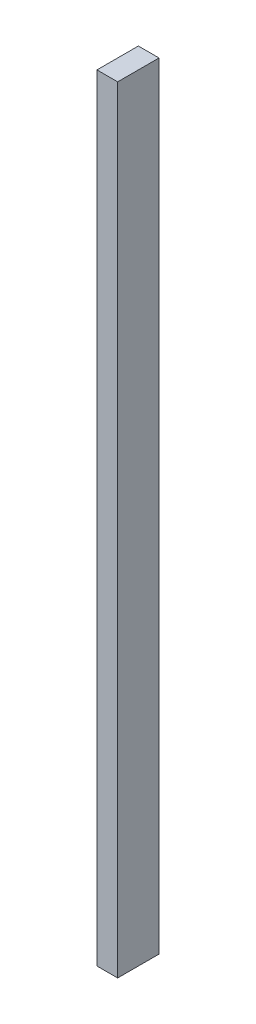
ISO-10303-21;
HEADER;
FILE_DESCRIPTION(('STEP AP214'),'2;1');
FILE_NAME('part.step','',(''),(''),'','','');
FILE_SCHEMA(('AUTOMOTIVE_DESIGN { 1 0 10303 214 1 1 1 1 }'));
ENDSEC;
DATA;
#1=APPLICATION_CONTEXT('core data for automotive mechanical design processes');
#2=APPLICATION_PROTOCOL_DEFINITION('international standard','automotive_design',2000,#1);
#3=PRODUCT_CONTEXT('',#1,'mechanical');
#4=PRODUCT('Part','Part','',(#3));
#5=PRODUCT_RELATED_PRODUCT_CATEGORY('part','',(#4));
#6=PRODUCT_DEFINITION_FORMATION('','',#4);
#7=PRODUCT_DEFINITION_CONTEXT('part definition',#1,'design');
#8=PRODUCT_DEFINITION('design','',#6,#7);
#9=PRODUCT_DEFINITION_SHAPE('','',#8);
#10=(LENGTH_UNIT() NAMED_UNIT(*) SI_UNIT(.MILLI.,.METRE.));
#11=(NAMED_UNIT(*) PLANE_ANGLE_UNIT() SI_UNIT($,.RADIAN.));
#12=(NAMED_UNIT(*) SI_UNIT($,.STERADIAN.) SOLID_ANGLE_UNIT());
#13=UNCERTAINTY_MEASURE_WITH_UNIT(LENGTH_MEASURE(1.E-05),#10,'distance_accuracy_value','');
#14=(GEOMETRIC_REPRESENTATION_CONTEXT(3) GLOBAL_UNCERTAINTY_ASSIGNED_CONTEXT((#13)) GLOBAL_UNIT_ASSIGNED_CONTEXT((#10,
#11,#12)) REPRESENTATION_CONTEXT('',''));
#15=CARTESIAN_POINT('',(0.,0.,0.));
#16=DIRECTION('',(0.,0.,1.));
#17=DIRECTION('',(1.,0.,0.));
#18=AXIS2_PLACEMENT_3D('',#15,#16,#17);
#19=CARTESIAN_POINT('',(0.,0.,1.6));
#20=DIRECTION('',(-1.,0.,0.));
#21=DIRECTION('',(0.,0.,1.));
#22=AXIS2_PLACEMENT_3D('',#19,#20,#21);
#23=PLANE('',#22);
#24=DIRECTION('',(0.,1.,0.));
#25=VECTOR('',#24,1.);
#26=CARTESIAN_POINT('',(0.,0.,0.));
#27=LINE('',#26,#25);
#28=CARTESIAN_POINT('',(0.,0.,0.));
#29=VERTEX_POINT('',#28);
#30=CARTESIAN_POINT('',(0.,30.,0.));
#31=VERTEX_POINT('',#30);
#32=EDGE_CURVE('E96',#29,#31,#27,.T.);
#33=ORIENTED_EDGE('',*,*,#32,.T.);
#34=DIRECTION('',(0.,0.,-1.));
#35=VECTOR('',#34,1.);
#36=CARTESIAN_POINT('',(0.,30.,1.6));
#37=LINE('',#36,#35);
#38=CARTESIAN_POINT('',(0.,30.,1.6));
#39=VERTEX_POINT('',#38);
#40=EDGE_CURVE('E11',#39,#31,#37,.T.);
#41=ORIENTED_EDGE('',*,*,#40,.F.);
#42=DIRECTION('',(0.,1.,0.));
#43=VECTOR('',#42,1.);
#44=CARTESIAN_POINT('',(0.,0.,1.6));
#45=LINE('',#44,#43);
#46=CARTESIAN_POINT('',(0.,0.,1.6));
#47=VERTEX_POINT('',#46);
#48=EDGE_CURVE('E84',#47,#39,#45,.T.);
#49=ORIENTED_EDGE('',*,*,#48,.F.);
#50=DIRECTION('',(0.,0.,-1.));
#51=VECTOR('',#50,1.);
#52=CARTESIAN_POINT('',(0.,0.,1.6));
#53=LINE('',#52,#51);
#54=EDGE_CURVE('E92',#47,#29,#53,.T.);
#55=ORIENTED_EDGE('',*,*,#54,.T.);
#56=EDGE_LOOP('',(#33,#41,#49,#55));
#57=FACE_BOUND('',#56,.T.);
#58=ADVANCED_FACE('F33',(#57),#23,.F.);
#59=CARTESIAN_POINT('',(0.,30.,1.6));
#60=DIRECTION('',(0.,-1.,0.));
#61=DIRECTION('',(1.,0.,0.));
#62=AXIS2_PLACEMENT_3D('',#59,#60,#61);
#63=PLANE('',#62);
#64=DIRECTION('',(-1.,0.,0.));
#65=VECTOR('',#64,1.);
#66=CARTESIAN_POINT('',(0.,30.,0.));
#67=LINE('',#66,#65);
#68=CARTESIAN_POINT('',(-0.8,30.,0.));
#69=VERTEX_POINT('',#68);
#70=EDGE_CURVE('E88',#31,#69,#67,.T.);
#71=ORIENTED_EDGE('',*,*,#70,.T.);
#72=DIRECTION('',(0.,0.,-1.));
#73=VECTOR('',#72,1.);
#74=CARTESIAN_POINT('',(-0.8,30.,1.6));
#75=LINE('',#74,#73);
#76=CARTESIAN_POINT('',(-0.8,30.,1.6));
#77=VERTEX_POINT('',#76);
#78=EDGE_CURVE('E41',#77,#69,#75,.T.);
#79=ORIENTED_EDGE('',*,*,#78,.F.);
#80=DIRECTION('',(-1.,0.,0.));
#81=VECTOR('',#80,1.);
#82=CARTESIAN_POINT('',(0.,30.,1.6));
#83=LINE('',#82,#81);
#84=EDGE_CURVE('E79',#39,#77,#83,.T.);
#85=ORIENTED_EDGE('',*,*,#84,.F.);
#86=ORIENTED_EDGE('',*,*,#40,.T.);
#87=EDGE_LOOP('',(#71,#79,#85,#86));
#88=FACE_BOUND('',#87,.T.);
#89=ADVANCED_FACE('F87',(#88),#63,.F.);
#90=CARTESIAN_POINT('',(-0.8,0.,1.6));
#91=DIRECTION('',(1.,0.,0.));
#92=DIRECTION('',(0.,0.,-1.));
#93=AXIS2_PLACEMENT_3D('',#90,#91,#92);
#94=PLANE('',#93);
#95=DIRECTION('',(0.,-1.,0.));
#96=VECTOR('',#95,1.);
#97=CARTESIAN_POINT('',(-0.8,0.,0.));
#98=LINE('',#97,#96);
#99=CARTESIAN_POINT('',(-0.8,0.,0.));
#100=VERTEX_POINT('',#99);
#101=EDGE_CURVE('E66',#69,#100,#98,.T.);
#102=ORIENTED_EDGE('',*,*,#101,.T.);
#103=DIRECTION('',(0.,0.,-1.));
#104=VECTOR('',#103,1.);
#105=CARTESIAN_POINT('',(-0.8,0.,1.6));
#106=LINE('',#105,#104);
#107=CARTESIAN_POINT('',(-0.8,0.,1.6));
#108=VERTEX_POINT('',#107);
#109=EDGE_CURVE('E89',#108,#100,#106,.T.);
#110=ORIENTED_EDGE('',*,*,#109,.F.);
#111=DIRECTION('',(0.,-1.,0.));
#112=VECTOR('',#111,1.);
#113=CARTESIAN_POINT('',(-0.8,0.,1.6));
#114=LINE('',#113,#112);
#115=EDGE_CURVE('E82',#77,#108,#114,.T.);
#116=ORIENTED_EDGE('',*,*,#115,.F.);
#117=ORIENTED_EDGE('',*,*,#78,.T.);
#118=EDGE_LOOP('',(#102,#110,#116,#117));
#119=FACE_BOUND('',#118,.T.);
#120=ADVANCED_FACE('F90',(#119),#94,.F.);
#121=CARTESIAN_POINT('',(0.,0.,1.6));
#122=DIRECTION('',(0.,1.,0.));
#123=DIRECTION('',(-1.,0.,0.));
#124=AXIS2_PLACEMENT_3D('',#121,#122,#123);
#125=PLANE('',#124);
#126=DIRECTION('',(1.,0.,0.));
#127=VECTOR('',#126,1.);
#128=CARTESIAN_POINT('',(0.,0.,0.));
#129=LINE('',#128,#127);
#130=EDGE_CURVE('E72',#100,#29,#129,.T.);
#131=ORIENTED_EDGE('',*,*,#130,.T.);
#132=ORIENTED_EDGE('',*,*,#54,.F.);
#133=DIRECTION('',(1.,0.,0.));
#134=VECTOR('',#133,1.);
#135=CARTESIAN_POINT('',(0.,0.,1.6));
#136=LINE('',#135,#134);
#137=EDGE_CURVE('E49',#108,#47,#136,.T.);
#138=ORIENTED_EDGE('',*,*,#137,.F.);
#139=ORIENTED_EDGE('',*,*,#109,.T.);
#140=EDGE_LOOP('',(#131,#132,#138,#139));
#141=FACE_BOUND('',#140,.T.);
#142=ADVANCED_FACE('F103',(#141),#125,.F.);
#143=CARTESIAN_POINT('',(0.,0.,1.6));
#144=DIRECTION('',(0.,0.,1.));
#145=DIRECTION('',(1.,0.,0.));
#146=AXIS2_PLACEMENT_3D('',#143,#144,#145);
#147=PLANE('',#146);
#148=ORIENTED_EDGE('',*,*,#48,.T.);
#149=ORIENTED_EDGE('',*,*,#84,.T.);
#150=ORIENTED_EDGE('',*,*,#115,.T.);
#151=ORIENTED_EDGE('',*,*,#137,.T.);
#152=EDGE_LOOP('',(#148,#149,#150,#151));
#153=FACE_BOUND('',#152,.T.);
#154=ADVANCED_FACE('F80',(#153),#147,.T.);
#155=CARTESIAN_POINT('',(0.,0.,0.));
#156=DIRECTION('',(0.,0.,1.));
#157=DIRECTION('',(1.,0.,0.));
#158=AXIS2_PLACEMENT_3D('',#155,#156,#157);
#159=PLANE('',#158);
#160=ORIENTED_EDGE('',*,*,#32,.F.);
#161=ORIENTED_EDGE('',*,*,#130,.F.);
#162=ORIENTED_EDGE('',*,*,#101,.F.);
#163=ORIENTED_EDGE('',*,*,#70,.F.);
#164=EDGE_LOOP('',(#160,#161,#162,#163));
#165=FACE_BOUND('',#164,.T.);
#166=ADVANCED_FACE('F106',(#165),#159,.F.);
#167=CLOSED_SHELL('',(#58,#89,#120,#142,#154,#166));
#168=MANIFOLD_SOLID_BREP('B2',#167);
#169=ADVANCED_BREP_SHAPE_REPRESENTATION('',(#18,#168),#14);
#170=SHAPE_DEFINITION_REPRESENTATION(#9,#169);
ENDSEC;
END-ISO-10303-21;
